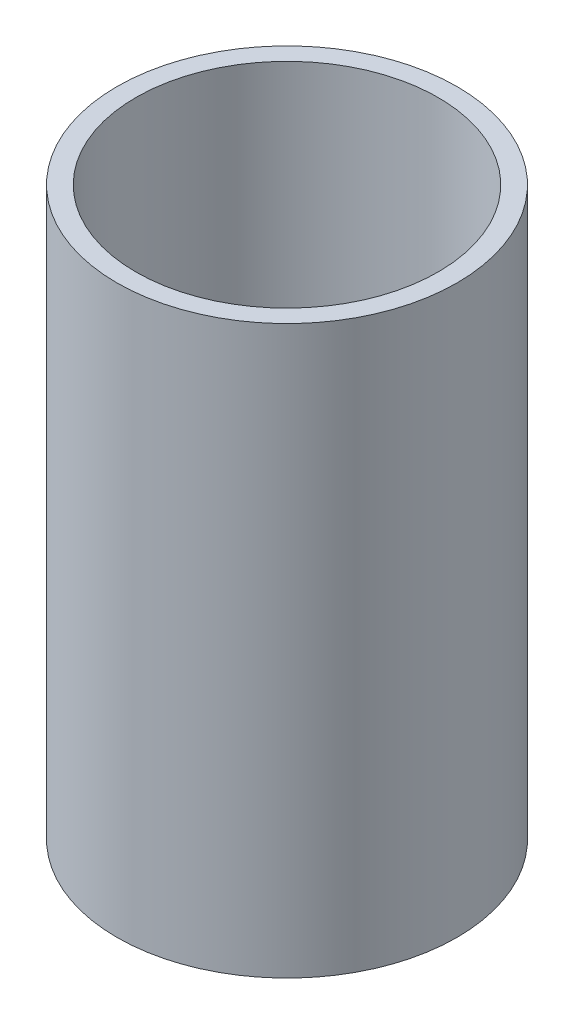
ISO-10303-21;
HEADER;
FILE_DESCRIPTION(('STEP AP214'),'2;1');
FILE_NAME('part.step','',(''),(''),'','','');
FILE_SCHEMA(('AUTOMOTIVE_DESIGN { 1 0 10303 214 1 1 1 1 }'));
ENDSEC;
DATA;
#1=APPLICATION_CONTEXT('core data for automotive mechanical design processes');
#2=APPLICATION_PROTOCOL_DEFINITION('international standard','automotive_design',2000,#1);
#3=PRODUCT_CONTEXT('',#1,'mechanical');
#4=PRODUCT('Part','Part','',(#3));
#5=PRODUCT_RELATED_PRODUCT_CATEGORY('part','',(#4));
#6=PRODUCT_DEFINITION_FORMATION('','',#4);
#7=PRODUCT_DEFINITION_CONTEXT('part definition',#1,'design');
#8=PRODUCT_DEFINITION('design','',#6,#7);
#9=PRODUCT_DEFINITION_SHAPE('','',#8);
#10=(LENGTH_UNIT() NAMED_UNIT(*) SI_UNIT(.MILLI.,.METRE.));
#11=(NAMED_UNIT(*) PLANE_ANGLE_UNIT() SI_UNIT($,.RADIAN.));
#12=(NAMED_UNIT(*) SI_UNIT($,.STERADIAN.) SOLID_ANGLE_UNIT());
#13=UNCERTAINTY_MEASURE_WITH_UNIT(LENGTH_MEASURE(1.E-05),#10,'distance_accuracy_value','');
#14=(GEOMETRIC_REPRESENTATION_CONTEXT(3) GLOBAL_UNCERTAINTY_ASSIGNED_CONTEXT((#13)) GLOBAL_UNIT_ASSIGNED_CONTEXT((#10,
#11,#12)) REPRESENTATION_CONTEXT('',''));
#15=CARTESIAN_POINT('',(0.,0.,0.));
#16=DIRECTION('',(0.,0.,1.));
#17=DIRECTION('',(1.,0.,0.));
#18=AXIS2_PLACEMENT_3D('',#15,#16,#17);
#19=CARTESIAN_POINT('',(0.,3.175,0.));
#20=DIRECTION('',(0.,-1.,0.));
#21=DIRECTION('',(0.,0.,-1.));
#22=AXIS2_PLACEMENT_3D('',#19,#20,#21);
#23=CYLINDRICAL_SURFACE('',#22,28.575);
#24=CARTESIAN_POINT('',(0.,0.,0.));
#25=DIRECTION('',(0.,1.,0.));
#26=DIRECTION('',(0.,0.,1.));
#27=AXIS2_PLACEMENT_3D('',#24,#25,#26);
#28=CIRCLE('',#27,28.575);
#29=CARTESIAN_POINT('',(0.,0.,28.575));
#30=VERTEX_POINT('',#29);
#31=EDGE_CURVE('E44',#30,#30,#28,.T.);
#32=ORIENTED_EDGE('',*,*,#31,.T.);
#33=EDGE_LOOP('',(#32));
#34=FACE_BOUND('',#33,.T.);
#35=CARTESIAN_POINT('',(0.,95.25,0.));
#36=DIRECTION('',(0.,1.,0.));
#37=DIRECTION('',(0.,0.,1.));
#38=AXIS2_PLACEMENT_3D('',#35,#36,#37);
#39=CIRCLE('',#38,28.575);
#40=CARTESIAN_POINT('',(0.,95.25,28.575));
#41=VERTEX_POINT('',#40);
#42=EDGE_CURVE('E49',#41,#41,#39,.T.);
#43=ORIENTED_EDGE('',*,*,#42,.F.);
#44=EDGE_LOOP('',(#43));
#45=FACE_BOUND('',#44,.T.);
#46=ADVANCED_FACE('F37',(#34,#45),#23,.T.);
#47=CARTESIAN_POINT('',(0.,0.,0.));
#48=DIRECTION('',(0.,1.,0.));
#49=DIRECTION('',(0.,0.,1.));
#50=AXIS2_PLACEMENT_3D('',#47,#48,#49);
#51=PLANE('',#50);
#52=ORIENTED_EDGE('',*,*,#31,.F.);
#53=EDGE_LOOP('',(#52));
#54=FACE_BOUND('',#53,.T.);
#55=ADVANCED_FACE('F65',(#54),#51,.F.);
#56=CARTESIAN_POINT('',(0.,95.25,0.));
#57=DIRECTION('',(0.,1.,0.));
#58=DIRECTION('',(0.,0.,1.));
#59=AXIS2_PLACEMENT_3D('',#56,#57,#58);
#60=PLANE('',#59);
#61=ORIENTED_EDGE('',*,*,#42,.T.);
#62=EDGE_LOOP('',(#61));
#63=FACE_BOUND('',#62,.T.);
#64=CARTESIAN_POINT('',(0.,95.25,0.));
#65=DIRECTION('',(0.,1.,0.));
#66=DIRECTION('',(0.,0.,1.));
#67=AXIS2_PLACEMENT_3D('',#64,#65,#66);
#68=CIRCLE('',#67,25.4);
#69=CARTESIAN_POINT('',(0.,95.25,25.4));
#70=VERTEX_POINT('',#69);
#71=EDGE_CURVE('E54',#70,#70,#68,.T.);
#72=ORIENTED_EDGE('',*,*,#71,.F.);
#73=EDGE_LOOP('',(#72));
#74=FACE_BOUND('',#73,.T.);
#75=ADVANCED_FACE('F63',(#63,#74),#60,.T.);
#76=CARTESIAN_POINT('',(0.,95.25,0.));
#77=DIRECTION('',(0.,-1.,0.));
#78=DIRECTION('',(0.,0.,-1.));
#79=AXIS2_PLACEMENT_3D('',#76,#77,#78);
#80=CYLINDRICAL_SURFACE('',#79,25.4);
#81=ORIENTED_EDGE('',*,*,#71,.T.);
#82=EDGE_LOOP('',(#81));
#83=FACE_BOUND('',#82,.T.);
#84=CARTESIAN_POINT('',(0.,3.175,0.));
#85=DIRECTION('',(0.,1.,0.));
#86=DIRECTION('',(0.,0.,1.));
#87=AXIS2_PLACEMENT_3D('',#84,#85,#86);
#88=CIRCLE('',#87,25.4);
#89=CARTESIAN_POINT('',(0.,3.175,25.4));
#90=VERTEX_POINT('',#89);
#91=EDGE_CURVE('E10',#90,#90,#88,.F.);
#92=ORIENTED_EDGE('',*,*,#91,.T.);
#93=EDGE_LOOP('',(#92));
#94=FACE_BOUND('',#93,.T.);
#95=ADVANCED_FACE('F61',(#83,#94),#80,.F.);
#96=CARTESIAN_POINT('',(0.,3.175,0.));
#97=DIRECTION('',(0.,1.,0.));
#98=DIRECTION('',(0.,0.,1.));
#99=AXIS2_PLACEMENT_3D('',#96,#97,#98);
#100=PLANE('',#99);
#101=ORIENTED_EDGE('',*,*,#91,.F.);
#102=EDGE_LOOP('',(#101));
#103=FACE_BOUND('',#102,.T.);
#104=ADVANCED_FACE('F72',(#103),#100,.T.);
#105=CLOSED_SHELL('',(#46,#55,#75,#95,#104));
#106=MANIFOLD_SOLID_BREP('B2',#105);
#107=ADVANCED_BREP_SHAPE_REPRESENTATION('',(#18,#106),#14);
#108=SHAPE_DEFINITION_REPRESENTATION(#9,#107);
ENDSEC;
END-ISO-10303-21;
